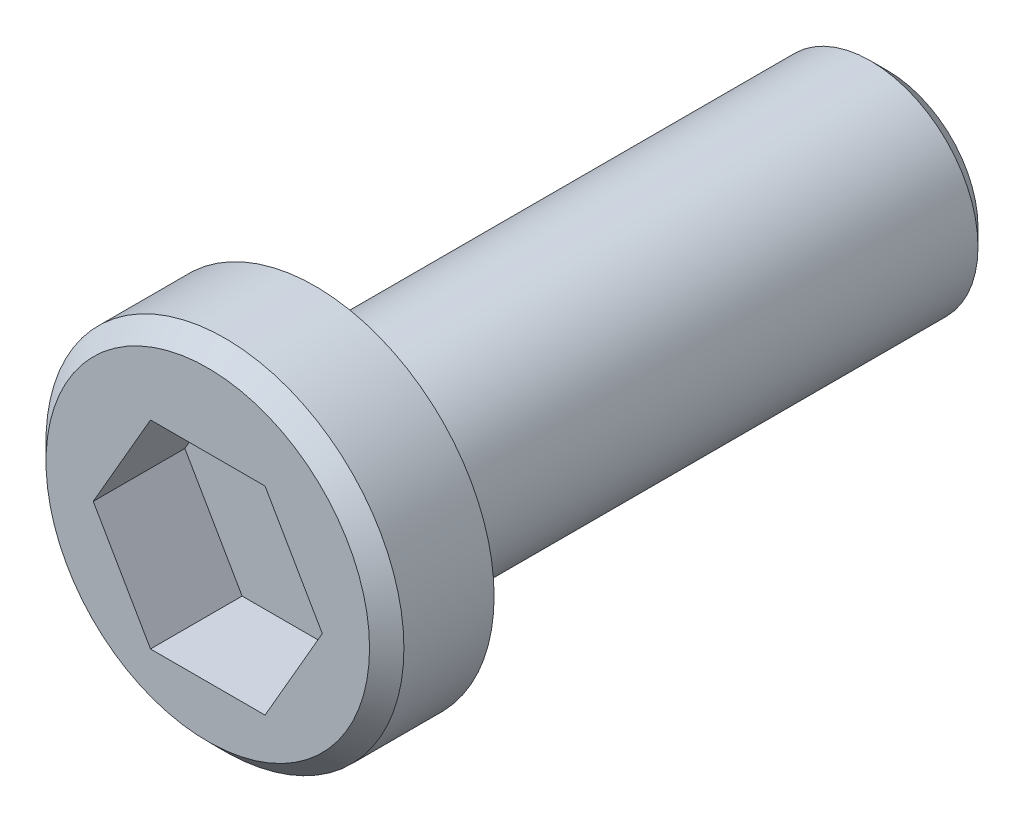
ISO-10303-21;
HEADER;
FILE_DESCRIPTION(('STEP AP214'),'2;1');
FILE_NAME('part.step','',(''),(''),'','','');
FILE_SCHEMA(('AUTOMOTIVE_DESIGN { 1 0 10303 214 1 1 1 1 }'));
ENDSEC;
DATA;
#1=APPLICATION_CONTEXT('core data for automotive mechanical design processes');
#2=APPLICATION_PROTOCOL_DEFINITION('international standard','automotive_design',2000,#1);
#3=PRODUCT_CONTEXT('',#1,'mechanical');
#4=PRODUCT('Part','Part','',(#3));
#5=PRODUCT_RELATED_PRODUCT_CATEGORY('part','',(#4));
#6=PRODUCT_DEFINITION_FORMATION('','',#4);
#7=PRODUCT_DEFINITION_CONTEXT('part definition',#1,'design');
#8=PRODUCT_DEFINITION('design','',#6,#7);
#9=PRODUCT_DEFINITION_SHAPE('','',#8);
#10=(LENGTH_UNIT() NAMED_UNIT(*) SI_UNIT(.MILLI.,.METRE.));
#11=(NAMED_UNIT(*) PLANE_ANGLE_UNIT() SI_UNIT($,.RADIAN.));
#12=(NAMED_UNIT(*) SI_UNIT($,.STERADIAN.) SOLID_ANGLE_UNIT());
#13=UNCERTAINTY_MEASURE_WITH_UNIT(LENGTH_MEASURE(1.E-05),#10,'distance_accuracy_value','');
#14=(GEOMETRIC_REPRESENTATION_CONTEXT(3) GLOBAL_UNCERTAINTY_ASSIGNED_CONTEXT((#13)) GLOBAL_UNIT_ASSIGNED_CONTEXT((#10,
#11,#12)) REPRESENTATION_CONTEXT('',''));
#15=CARTESIAN_POINT('',(0.,0.,0.));
#16=DIRECTION('',(0.,0.,1.));
#17=DIRECTION('',(1.,0.,0.));
#18=AXIS2_PLACEMENT_3D('',#15,#16,#17);
#19=CARTESIAN_POINT('',(0.,0.,25.4));
#20=DIRECTION('',(0.,0.,-1.));
#21=DIRECTION('',(-1.,0.,0.));
#22=AXIS2_PLACEMENT_3D('',#19,#20,#21);
#23=CYLINDRICAL_SURFACE('',#22,4.7625);
#24=CARTESIAN_POINT('',(0.,0.,0.761999999999999));
#25=DIRECTION('',(0.,0.,1.));
#26=DIRECTION('',(1.,0.,0.));
#27=AXIS2_PLACEMENT_3D('',#24,#25,#26);
#28=CIRCLE('',#27,4.7625);
#29=CARTESIAN_POINT('',(4.7625,0.,0.761999999999999));
#30=VERTEX_POINT('',#29);
#31=EDGE_CURVE('E161',#30,#30,#28,.T.);
#32=ORIENTED_EDGE('',*,*,#31,.T.);
#33=EDGE_LOOP('',(#32));
#34=FACE_BOUND('',#33,.T.);
#35=CARTESIAN_POINT('',(0.,0.,25.4));
#36=DIRECTION('',(0.,0.,1.));
#37=DIRECTION('',(1.,0.,0.));
#38=AXIS2_PLACEMENT_3D('',#35,#36,#37);
#39=CIRCLE('',#38,4.7625);
#40=CARTESIAN_POINT('',(4.7625,0.,25.4));
#41=VERTEX_POINT('',#40);
#42=EDGE_CURVE('E158',#41,#41,#39,.T.);
#43=ORIENTED_EDGE('',*,*,#42,.F.);
#44=EDGE_LOOP('',(#43));
#45=FACE_BOUND('',#44,.T.);
#46=ADVANCED_FACE('F46',(#34,#45),#23,.T.);
#47=CARTESIAN_POINT('',(0.,0.,0.));
#48=DIRECTION('',(0.,0.,1.));
#49=DIRECTION('',(1.,0.,0.));
#50=AXIS2_PLACEMENT_3D('',#47,#48,#49);
#51=PLANE('',#50);
#52=CARTESIAN_POINT('',(0.,0.,0.));
#53=DIRECTION('',(0.,0.,1.));
#54=DIRECTION('',(1.,0.,0.));
#55=AXIS2_PLACEMENT_3D('',#52,#53,#54);
#56=CIRCLE('',#55,4.0005);
#57=CARTESIAN_POINT('',(4.0005,0.,0.));
#58=VERTEX_POINT('',#57);
#59=EDGE_CURVE('E164',#58,#58,#56,.F.);
#60=ORIENTED_EDGE('',*,*,#59,.T.);
#61=EDGE_LOOP('',(#60));
#62=FACE_BOUND('',#61,.T.);
#63=ADVANCED_FACE('F185',(#62),#51,.F.);
#64=CARTESIAN_POINT('',(0.,0.491553117569765,25.4));
#65=DIRECTION('',(0.,0.,1.));
#66=DIRECTION('',(1.,0.,0.));
#67=AXIS2_PLACEMENT_3D('',#64,#65,#66);
#68=PLANE('',#67);
#69=CARTESIAN_POINT('',(0.,0.491553117569765,25.4));
#70=DIRECTION('',(0.,0.,1.));
#71=DIRECTION('',(1.,0.,0.));
#72=AXIS2_PLACEMENT_3D('',#69,#70,#71);
#73=CIRCLE('',#72,7.9375);
#74=CARTESIAN_POINT('',(7.9375,0.491553117569765,25.4));
#75=VERTEX_POINT('',#74);
#76=EDGE_CURVE('E149',#75,#75,#73,.T.);
#77=ORIENTED_EDGE('',*,*,#76,.F.);
#78=EDGE_LOOP('',(#77));
#79=FACE_BOUND('',#78,.T.);
#80=ORIENTED_EDGE('',*,*,#42,.T.);
#81=EDGE_LOOP('',(#80));
#82=FACE_BOUND('',#81,.T.);
#83=ADVANCED_FACE('F190',(#79,#82),#68,.F.);
#84=CARTESIAN_POINT('',(0.,0.491553117569765,30.1625));
#85=DIRECTION('',(0.,0.,-1.));
#86=DIRECTION('',(-1.,0.,0.));
#87=AXIS2_PLACEMENT_3D('',#84,#85,#86);
#88=CYLINDRICAL_SURFACE('',#87,7.9375);
#89=CARTESIAN_POINT('',(0.,0.491553117569765,29.4005));
#90=DIRECTION('',(0.,0.,1.));
#91=DIRECTION('',(1.,0.,0.));
#92=AXIS2_PLACEMENT_3D('',#89,#90,#91);
#93=CIRCLE('',#92,7.9375);
#94=CARTESIAN_POINT('',(7.9375,0.491553117569765,29.4005));
#95=VERTEX_POINT('',#94);
#96=EDGE_CURVE('E13',#95,#95,#93,.F.);
#97=ORIENTED_EDGE('',*,*,#96,.T.);
#98=EDGE_LOOP('',(#97));
#99=FACE_BOUND('',#98,.T.);
#100=ORIENTED_EDGE('',*,*,#76,.T.);
#101=EDGE_LOOP('',(#100));
#102=FACE_BOUND('',#101,.T.);
#103=ADVANCED_FACE('F197',(#99,#102),#88,.T.);
#104=CARTESIAN_POINT('',(0.,0.491553117569765,30.1625));
#105=DIRECTION('',(0.,0.,1.));
#106=DIRECTION('',(1.,0.,0.));
#107=AXIS2_PLACEMENT_3D('',#104,#105,#106);
#108=PLANE('',#107);
#109=DIRECTION('',(1.,0.,0.));
#110=VECTOR('',#109,1.);
#111=CARTESIAN_POINT('',(-2.54,-4.39940905122495,30.1625));
#112=LINE('',#111,#110);
#113=CARTESIAN_POINT('',(-2.54,-4.39940905122495,30.1625));
#114=VERTEX_POINT('',#113);
#115=CARTESIAN_POINT('',(2.54,-4.39940905122495,30.1625));
#116=VERTEX_POINT('',#115);
#117=EDGE_CURVE('E131',#114,#116,#112,.T.);
#118=ORIENTED_EDGE('',*,*,#117,.F.);
#119=DIRECTION('',(0.5,-0.866025403784438,0.));
#120=VECTOR('',#119,1.);
#121=CARTESIAN_POINT('',(-5.08,0.,30.1625));
#122=LINE('',#121,#120);
#123=CARTESIAN_POINT('',(-5.08,0.,30.1625));
#124=VERTEX_POINT('',#123);
#125=EDGE_CURVE('E125',#124,#114,#122,.T.);
#126=ORIENTED_EDGE('',*,*,#125,.F.);
#127=DIRECTION('',(-0.5,-0.866025403784439,0.));
#128=VECTOR('',#127,1.);
#129=CARTESIAN_POINT('',(-2.54,4.39940905122495,30.1625));
#130=LINE('',#129,#128);
#131=CARTESIAN_POINT('',(-2.54,4.39940905122495,30.1625));
#132=VERTEX_POINT('',#131);
#133=EDGE_CURVE('E123',#132,#124,#130,.T.);
#134=ORIENTED_EDGE('',*,*,#133,.F.);
#135=DIRECTION('',(-1.,0.,0.));
#136=VECTOR('',#135,1.);
#137=CARTESIAN_POINT('',(2.54,4.39940905122495,30.1625));
#138=LINE('',#137,#136);
#139=CARTESIAN_POINT('',(2.54,4.39940905122495,30.1625));
#140=VERTEX_POINT('',#139);
#141=EDGE_CURVE('E103',#140,#132,#138,.T.);
#142=ORIENTED_EDGE('',*,*,#141,.F.);
#143=DIRECTION('',(-0.5,0.866025403784438,0.));
#144=VECTOR('',#143,1.);
#145=CARTESIAN_POINT('',(5.08,0.,30.1625));
#146=LINE('',#145,#144);
#147=CARTESIAN_POINT('',(5.08,0.,30.1625));
#148=VERTEX_POINT('',#147);
#149=EDGE_CURVE('E114',#148,#140,#146,.T.);
#150=ORIENTED_EDGE('',*,*,#149,.F.);
#151=DIRECTION('',(0.499999999999999,0.866025403784439,0.));
#152=VECTOR('',#151,1.);
#153=CARTESIAN_POINT('',(2.54,-4.39940905122495,30.1625));
#154=LINE('',#153,#152);
#155=EDGE_CURVE('E60',#116,#148,#154,.T.);
#156=ORIENTED_EDGE('',*,*,#155,.F.);
#157=EDGE_LOOP('',(#118,#126,#134,#142,#150,#156));
#158=FACE_BOUND('',#157,.T.);
#159=CARTESIAN_POINT('',(0.,0.491553117569765,30.1625));
#160=DIRECTION('',(0.,0.,1.));
#161=DIRECTION('',(1.,0.,0.));
#162=AXIS2_PLACEMENT_3D('',#159,#160,#161);
#163=CIRCLE('',#162,7.1755);
#164=CARTESIAN_POINT('',(7.1755,0.491553117569765,30.1625));
#165=VERTEX_POINT('',#164);
#166=EDGE_CURVE('E53',#165,#165,#163,.T.);
#167=ORIENTED_EDGE('',*,*,#166,.T.);
#168=EDGE_LOOP('',(#167));
#169=FACE_BOUND('',#168,.T.);
#170=ADVANCED_FACE('F119',(#158,#169),#108,.T.);
#171=CARTESIAN_POINT('',(0.,0.,0.761999999999999));
#172=DIRECTION('',(0.,0.,1.));
#173=DIRECTION('',(1.,0.,0.));
#174=AXIS2_PLACEMENT_3D('',#171,#172,#173);
#175=CONICAL_SURFACE('',#174,4.7625,0.785398163397451);
#176=ORIENTED_EDGE('',*,*,#59,.F.);
#177=EDGE_LOOP('',(#176));
#178=FACE_BOUND('',#177,.T.);
#179=ORIENTED_EDGE('',*,*,#31,.F.);
#180=EDGE_LOOP('',(#179));
#181=FACE_BOUND('',#180,.T.);
#182=ADVANCED_FACE('F172',(#178,#181),#175,.T.);
#183=CARTESIAN_POINT('',(0.,0.491553117569765,30.1625));
#184=DIRECTION('',(0.,0.,-1.));
#185=DIRECTION('',(-1.,0.,0.));
#186=AXIS2_PLACEMENT_3D('',#183,#184,#185);
#187=CONICAL_SURFACE('',#186,7.1755,0.785398163397448);
#188=ORIENTED_EDGE('',*,*,#96,.F.);
#189=EDGE_LOOP('',(#188));
#190=FACE_BOUND('',#189,.T.);
#191=ORIENTED_EDGE('',*,*,#166,.F.);
#192=EDGE_LOOP('',(#191));
#193=FACE_BOUND('',#192,.T.);
#194=ADVANCED_FACE('F169',(#190,#193),#187,.T.);
#195=CARTESIAN_POINT('',(2.54,-4.39940905122495,26.0985));
#196=DIRECTION('',(0.866025403784439,-0.5,0.));
#197=DIRECTION('',(0.5,0.866025403784439,0.));
#198=AXIS2_PLACEMENT_3D('',#195,#196,#197);
#199=PLANE('',#198);
#200=ORIENTED_EDGE('',*,*,#155,.T.);
#201=DIRECTION('',(0.,0.,1.));
#202=VECTOR('',#201,1.);
#203=CARTESIAN_POINT('',(5.08,0.,26.0985));
#204=LINE('',#203,#202);
#205=CARTESIAN_POINT('',(5.08,0.,26.0985));
#206=VERTEX_POINT('',#205);
#207=EDGE_CURVE('E111',#206,#148,#204,.T.);
#208=ORIENTED_EDGE('',*,*,#207,.F.);
#209=DIRECTION('',(0.499999999999999,0.866025403784439,0.));
#210=VECTOR('',#209,1.);
#211=CARTESIAN_POINT('',(2.54,-4.39940905122495,26.0985));
#212=LINE('',#211,#210);
#213=CARTESIAN_POINT('',(2.54,-4.39940905122495,26.0985));
#214=VERTEX_POINT('',#213);
#215=EDGE_CURVE('E133',#214,#206,#212,.T.);
#216=ORIENTED_EDGE('',*,*,#215,.F.);
#217=DIRECTION('',(0.,0.,1.));
#218=VECTOR('',#217,1.);
#219=CARTESIAN_POINT('',(2.54,-4.39940905122495,26.0985));
#220=LINE('',#219,#218);
#221=EDGE_CURVE('E67',#214,#116,#220,.T.);
#222=ORIENTED_EDGE('',*,*,#221,.T.);
#223=EDGE_LOOP('',(#200,#208,#216,#222));
#224=FACE_BOUND('',#223,.T.);
#225=ADVANCED_FACE('F171',(#224),#199,.F.);
#226=CARTESIAN_POINT('',(-2.54,-4.39940905122495,26.0985));
#227=DIRECTION('',(0.,-1.,0.));
#228=DIRECTION('',(1.,0.,0.));
#229=AXIS2_PLACEMENT_3D('',#226,#227,#228);
#230=PLANE('',#229);
#231=ORIENTED_EDGE('',*,*,#117,.T.);
#232=ORIENTED_EDGE('',*,*,#221,.F.);
#233=DIRECTION('',(1.,0.,0.));
#234=VECTOR('',#233,1.);
#235=CARTESIAN_POINT('',(-2.54,-4.39940905122495,26.0985));
#236=LINE('',#235,#234);
#237=CARTESIAN_POINT('',(-2.54,-4.39940905122495,26.0985));
#238=VERTEX_POINT('',#237);
#239=EDGE_CURVE('E145',#238,#214,#236,.T.);
#240=ORIENTED_EDGE('',*,*,#239,.F.);
#241=DIRECTION('',(0.,0.,1.));
#242=VECTOR('',#241,1.);
#243=CARTESIAN_POINT('',(-2.54,-4.39940905122495,26.0985));
#244=LINE('',#243,#242);
#245=EDGE_CURVE('E150',#238,#114,#244,.T.);
#246=ORIENTED_EDGE('',*,*,#245,.T.);
#247=EDGE_LOOP('',(#231,#232,#240,#246));
#248=FACE_BOUND('',#247,.T.);
#249=ADVANCED_FACE('F179',(#248),#230,.F.);
#250=CARTESIAN_POINT('',(-5.08,0.,26.0985));
#251=DIRECTION('',(-0.866025403784439,-0.5,0.));
#252=DIRECTION('',(0.5,-0.866025403784439,0.));
#253=AXIS2_PLACEMENT_3D('',#250,#251,#252);
#254=PLANE('',#253);
#255=ORIENTED_EDGE('',*,*,#125,.T.);
#256=ORIENTED_EDGE('',*,*,#245,.F.);
#257=DIRECTION('',(0.5,-0.866025403784438,0.));
#258=VECTOR('',#257,1.);
#259=CARTESIAN_POINT('',(-5.08,0.,26.0985));
#260=LINE('',#259,#258);
#261=CARTESIAN_POINT('',(-5.08,0.,26.0985));
#262=VERTEX_POINT('',#261);
#263=EDGE_CURVE('E142',#262,#238,#260,.T.);
#264=ORIENTED_EDGE('',*,*,#263,.F.);
#265=DIRECTION('',(0.,0.,1.));
#266=VECTOR('',#265,1.);
#267=CARTESIAN_POINT('',(-5.08,0.,26.0985));
#268=LINE('',#267,#266);
#269=EDGE_CURVE('E152',#262,#124,#268,.T.);
#270=ORIENTED_EDGE('',*,*,#269,.T.);
#271=EDGE_LOOP('',(#255,#256,#264,#270));
#272=FACE_BOUND('',#271,.T.);
#273=ADVANCED_FACE('F238',(#272),#254,.F.);
#274=CARTESIAN_POINT('',(-2.54,4.39940905122495,26.0985));
#275=DIRECTION('',(-0.866025403784439,0.5,0.));
#276=DIRECTION('',(-0.5,-0.866025403784439,0.));
#277=AXIS2_PLACEMENT_3D('',#274,#275,#276);
#278=PLANE('',#277);
#279=ORIENTED_EDGE('',*,*,#133,.T.);
#280=ORIENTED_EDGE('',*,*,#269,.F.);
#281=DIRECTION('',(-0.5,-0.866025403784439,0.));
#282=VECTOR('',#281,1.);
#283=CARTESIAN_POINT('',(-2.54,4.39940905122495,26.0985));
#284=LINE('',#283,#282);
#285=CARTESIAN_POINT('',(-2.54,4.39940905122495,26.0985));
#286=VERTEX_POINT('',#285);
#287=EDGE_CURVE('E139',#286,#262,#284,.T.);
#288=ORIENTED_EDGE('',*,*,#287,.F.);
#289=DIRECTION('',(0.,0.,1.));
#290=VECTOR('',#289,1.);
#291=CARTESIAN_POINT('',(-2.54,4.39940905122495,26.0985));
#292=LINE('',#291,#290);
#293=EDGE_CURVE('E110',#286,#132,#292,.T.);
#294=ORIENTED_EDGE('',*,*,#293,.T.);
#295=EDGE_LOOP('',(#279,#280,#288,#294));
#296=FACE_BOUND('',#295,.T.);
#297=ADVANCED_FACE('F246',(#296),#278,.F.);
#298=CARTESIAN_POINT('',(2.54,4.39940905122495,26.0985));
#299=DIRECTION('',(0.,1.,0.));
#300=DIRECTION('',(0.,0.,1.));
#301=AXIS2_PLACEMENT_3D('',#298,#299,#300);
#302=PLANE('',#301);
#303=ORIENTED_EDGE('',*,*,#141,.T.);
#304=ORIENTED_EDGE('',*,*,#293,.F.);
#305=DIRECTION('',(-1.,0.,0.));
#306=VECTOR('',#305,1.);
#307=CARTESIAN_POINT('',(2.54,4.39940905122495,26.0985));
#308=LINE('',#307,#306);
#309=CARTESIAN_POINT('',(2.54,4.39940905122495,26.0985));
#310=VERTEX_POINT('',#309);
#311=EDGE_CURVE('E106',#310,#286,#308,.T.);
#312=ORIENTED_EDGE('',*,*,#311,.F.);
#313=DIRECTION('',(0.,0.,1.));
#314=VECTOR('',#313,1.);
#315=CARTESIAN_POINT('',(2.54,4.39940905122495,26.0985));
#316=LINE('',#315,#314);
#317=EDGE_CURVE('E99',#310,#140,#316,.T.);
#318=ORIENTED_EDGE('',*,*,#317,.T.);
#319=EDGE_LOOP('',(#303,#304,#312,#318));
#320=FACE_BOUND('',#319,.T.);
#321=ADVANCED_FACE('F101',(#320),#302,.F.);
#322=CARTESIAN_POINT('',(5.08,0.,26.0985));
#323=DIRECTION('',(0.866025403784438,0.5,0.));
#324=DIRECTION('',(-0.5,0.866025403784439,0.));
#325=AXIS2_PLACEMENT_3D('',#322,#323,#324);
#326=PLANE('',#325);
#327=ORIENTED_EDGE('',*,*,#149,.T.);
#328=ORIENTED_EDGE('',*,*,#317,.F.);
#329=DIRECTION('',(-0.5,0.866025403784438,0.));
#330=VECTOR('',#329,1.);
#331=CARTESIAN_POINT('',(5.08,0.,26.0985));
#332=LINE('',#331,#330);
#333=EDGE_CURVE('E136',#206,#310,#332,.T.);
#334=ORIENTED_EDGE('',*,*,#333,.F.);
#335=ORIENTED_EDGE('',*,*,#207,.T.);
#336=EDGE_LOOP('',(#327,#328,#334,#335));
#337=FACE_BOUND('',#336,.T.);
#338=ADVANCED_FACE('F115',(#337),#326,.F.);
#339=CARTESIAN_POINT('',(7.62,4.39940905122495,26.0985));
#340=DIRECTION('',(0.,0.,1.));
#341=DIRECTION('',(1.,0.,0.));
#342=AXIS2_PLACEMENT_3D('',#339,#340,#341);
#343=PLANE('',#342);
#344=ORIENTED_EDGE('',*,*,#215,.T.);
#345=ORIENTED_EDGE('',*,*,#333,.T.);
#346=ORIENTED_EDGE('',*,*,#311,.T.);
#347=ORIENTED_EDGE('',*,*,#287,.T.);
#348=ORIENTED_EDGE('',*,*,#263,.T.);
#349=ORIENTED_EDGE('',*,*,#239,.T.);
#350=EDGE_LOOP('',(#344,#345,#346,#347,#348,#349));
#351=FACE_BOUND('',#350,.T.);
#352=ADVANCED_FACE('F270',(#351),#343,.T.);
#353=CLOSED_SHELL('',(#46,#63,#83,#103,#170,#182,#194,#225,#249,#273,#297,#321,#338,#352));
#354=MANIFOLD_SOLID_BREP('B2',#353);
#355=ADVANCED_BREP_SHAPE_REPRESENTATION('',(#18,#354),#14);
#356=SHAPE_DEFINITION_REPRESENTATION(#9,#355);
ENDSEC;
END-ISO-10303-21;
